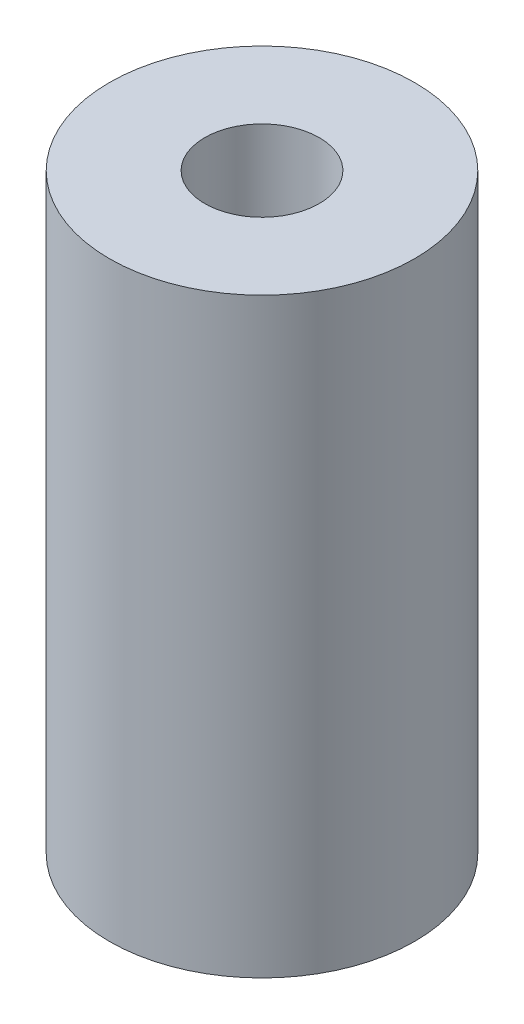
ISO-10303-21;
HEADER;
FILE_DESCRIPTION(('STEP AP214'),'2;1');
FILE_NAME('part.step','',(''),(''),'','','');
FILE_SCHEMA(('AUTOMOTIVE_DESIGN { 1 0 10303 214 1 1 1 1 }'));
ENDSEC;
DATA;
#1=APPLICATION_CONTEXT('core data for automotive mechanical design processes');
#2=APPLICATION_PROTOCOL_DEFINITION('international standard','automotive_design',2000,#1);
#3=PRODUCT_CONTEXT('',#1,'mechanical');
#4=PRODUCT('Part','Part','',(#3));
#5=PRODUCT_RELATED_PRODUCT_CATEGORY('part','',(#4));
#6=PRODUCT_DEFINITION_FORMATION('','',#4);
#7=PRODUCT_DEFINITION_CONTEXT('part definition',#1,'design');
#8=PRODUCT_DEFINITION('design','',#6,#7);
#9=PRODUCT_DEFINITION_SHAPE('','',#8);
#10=(LENGTH_UNIT() NAMED_UNIT(*) SI_UNIT(.MILLI.,.METRE.));
#11=(NAMED_UNIT(*) PLANE_ANGLE_UNIT() SI_UNIT($,.RADIAN.));
#12=(NAMED_UNIT(*) SI_UNIT($,.STERADIAN.) SOLID_ANGLE_UNIT());
#13=UNCERTAINTY_MEASURE_WITH_UNIT(LENGTH_MEASURE(1.E-05),#10,'distance_accuracy_value','');
#14=(GEOMETRIC_REPRESENTATION_CONTEXT(3) GLOBAL_UNCERTAINTY_ASSIGNED_CONTEXT((#13)) GLOBAL_UNIT_ASSIGNED_CONTEXT((#10,
#11,#12)) REPRESENTATION_CONTEXT('',''));
#15=CARTESIAN_POINT('',(0.,0.,0.));
#16=DIRECTION('',(0.,0.,1.));
#17=DIRECTION('',(1.,0.,0.));
#18=AXIS2_PLACEMENT_3D('',#15,#16,#17);
#19=CARTESIAN_POINT('',(0.,0.,0.));
#20=DIRECTION('',(0.,-1.,0.));
#21=DIRECTION('',(0.,0.,-1.));
#22=AXIS2_PLACEMENT_3D('',#19,#20,#21);
#23=CYLINDRICAL_SURFACE('',#22,1.5);
#24=CARTESIAN_POINT('',(0.,0.0365905874078542,0.));
#25=DIRECTION('',(0.,-1.,0.));
#26=DIRECTION('',(0.,0.,-1.));
#27=AXIS2_PLACEMENT_3D('',#24,#25,#26);
#28=CIRCLE('',#27,1.5);
#29=CARTESIAN_POINT('',(0.,0.0365905874078542,-1.5));
#30=VERTEX_POINT('',#29);
#31=EDGE_CURVE('E49',#30,#30,#28,.T.);
#32=ORIENTED_EDGE('',*,*,#31,.T.);
#33=EDGE_LOOP('',(#32));
#34=FACE_BOUND('',#33,.T.);
#35=CARTESIAN_POINT('',(0.,15.5365905874079,0.));
#36=DIRECTION('',(0.,-1.,0.));
#37=DIRECTION('',(0.,0.,-1.));
#38=AXIS2_PLACEMENT_3D('',#35,#36,#37);
#39=CIRCLE('',#38,1.5);
#40=CARTESIAN_POINT('',(0.,15.5365905874079,-1.5));
#41=VERTEX_POINT('',#40);
#42=EDGE_CURVE('E10',#41,#41,#39,.T.);
#43=ORIENTED_EDGE('',*,*,#42,.F.);
#44=EDGE_LOOP('',(#43));
#45=FACE_BOUND('',#44,.T.);
#46=ADVANCED_FACE('F35',(#34,#45),#23,.F.);
#47=CARTESIAN_POINT('',(1.5,15.5365905874079,0.));
#48=DIRECTION('',(0.,1.,0.));
#49=DIRECTION('',(0.,0.,1.));
#50=AXIS2_PLACEMENT_3D('',#47,#48,#49);
#51=PLANE('',#50);
#52=ORIENTED_EDGE('',*,*,#42,.T.);
#53=EDGE_LOOP('',(#52));
#54=FACE_BOUND('',#53,.T.);
#55=CARTESIAN_POINT('',(0.,15.5365905874079,0.));
#56=DIRECTION('',(0.,-1.,0.));
#57=DIRECTION('',(0.,0.,-1.));
#58=AXIS2_PLACEMENT_3D('',#55,#56,#57);
#59=CIRCLE('',#58,4.);
#60=CARTESIAN_POINT('',(0.,15.5365905874079,-4.));
#61=VERTEX_POINT('',#60);
#62=EDGE_CURVE('E41',#61,#61,#59,.T.);
#63=ORIENTED_EDGE('',*,*,#62,.F.);
#64=EDGE_LOOP('',(#63));
#65=FACE_BOUND('',#64,.T.);
#66=ADVANCED_FACE('F65',(#54,#65),#51,.T.);
#67=CARTESIAN_POINT('',(0.,0.,0.));
#68=DIRECTION('',(0.,-1.,0.));
#69=DIRECTION('',(0.,0.,-1.));
#70=AXIS2_PLACEMENT_3D('',#67,#68,#69);
#71=CYLINDRICAL_SURFACE('',#70,4.);
#72=ORIENTED_EDGE('',*,*,#62,.T.);
#73=EDGE_LOOP('',(#72));
#74=FACE_BOUND('',#73,.T.);
#75=CARTESIAN_POINT('',(0.,0.0365905874078545,0.));
#76=DIRECTION('',(0.,-1.,0.));
#77=DIRECTION('',(0.,0.,-1.));
#78=AXIS2_PLACEMENT_3D('',#75,#76,#77);
#79=CIRCLE('',#78,4.);
#80=CARTESIAN_POINT('',(0.,0.0365905874078545,-4.));
#81=VERTEX_POINT('',#80);
#82=EDGE_CURVE('E45',#81,#81,#79,.T.);
#83=ORIENTED_EDGE('',*,*,#82,.F.);
#84=EDGE_LOOP('',(#83));
#85=FACE_BOUND('',#84,.T.);
#86=ADVANCED_FACE('F59',(#74,#85),#71,.T.);
#87=CARTESIAN_POINT('',(4.,0.0365905874078544,0.));
#88=DIRECTION('',(0.,-1.,0.));
#89=DIRECTION('',(0.,0.,-1.));
#90=AXIS2_PLACEMENT_3D('',#87,#88,#89);
#91=PLANE('',#90);
#92=ORIENTED_EDGE('',*,*,#82,.T.);
#93=EDGE_LOOP('',(#92));
#94=FACE_BOUND('',#93,.T.);
#95=ORIENTED_EDGE('',*,*,#31,.F.);
#96=EDGE_LOOP('',(#95));
#97=FACE_BOUND('',#96,.T.);
#98=ADVANCED_FACE('F57',(#94,#97),#91,.T.);
#99=CLOSED_SHELL('',(#46,#66,#86,#98));
#100=MANIFOLD_SOLID_BREP('B2',#99);
#101=ADVANCED_BREP_SHAPE_REPRESENTATION('',(#18,#100),#14);
#102=SHAPE_DEFINITION_REPRESENTATION(#9,#101);
ENDSEC;
END-ISO-10303-21;
